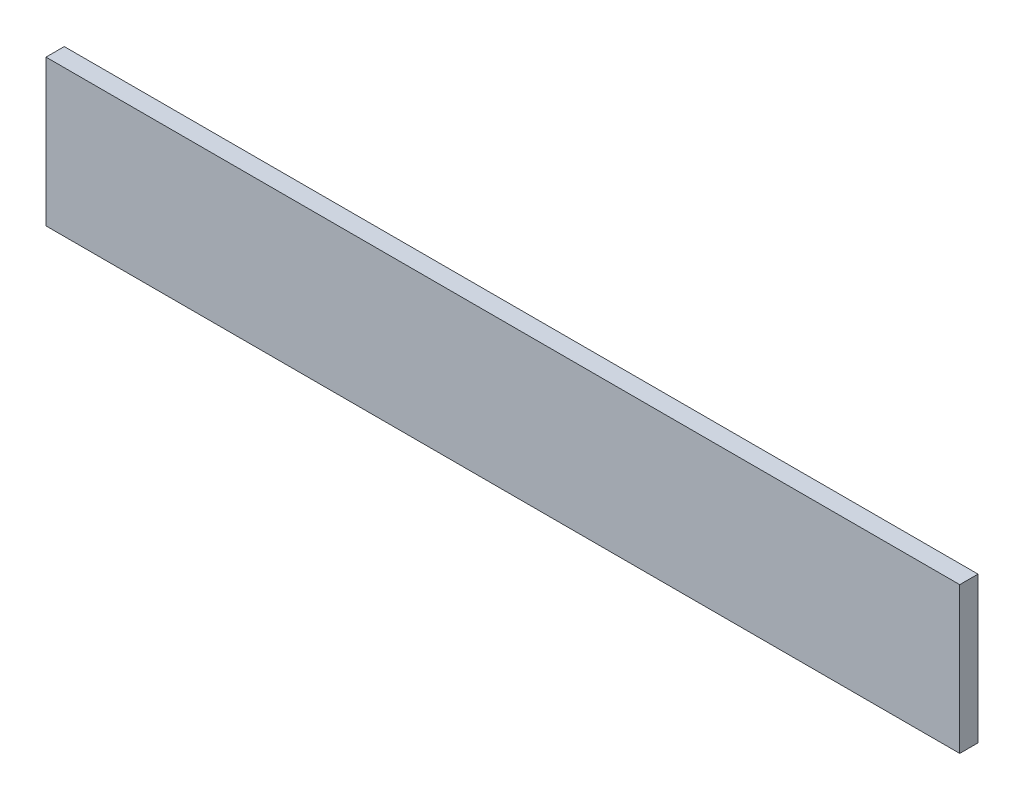
ISO-10303-21;
HEADER;
FILE_DESCRIPTION(('STEP AP214'),'2;1');
FILE_NAME('part.step','',(''),(''),'','','');
FILE_SCHEMA(('AUTOMOTIVE_DESIGN { 1 0 10303 214 1 1 1 1 }'));
ENDSEC;
DATA;
#1=APPLICATION_CONTEXT('core data for automotive mechanical design processes');
#2=APPLICATION_PROTOCOL_DEFINITION('international standard','automotive_design',2000,#1);
#3=PRODUCT_CONTEXT('',#1,'mechanical');
#4=PRODUCT('Part','Part','',(#3));
#5=PRODUCT_RELATED_PRODUCT_CATEGORY('part','',(#4));
#6=PRODUCT_DEFINITION_FORMATION('','',#4);
#7=PRODUCT_DEFINITION_CONTEXT('part definition',#1,'design');
#8=PRODUCT_DEFINITION('design','',#6,#7);
#9=PRODUCT_DEFINITION_SHAPE('','',#8);
#10=(LENGTH_UNIT() NAMED_UNIT(*) SI_UNIT(.MILLI.,.METRE.));
#11=(NAMED_UNIT(*) PLANE_ANGLE_UNIT() SI_UNIT($,.RADIAN.));
#12=(NAMED_UNIT(*) SI_UNIT($,.STERADIAN.) SOLID_ANGLE_UNIT());
#13=UNCERTAINTY_MEASURE_WITH_UNIT(LENGTH_MEASURE(1.E-05),#10,'distance_accuracy_value','');
#14=(GEOMETRIC_REPRESENTATION_CONTEXT(3) GLOBAL_UNCERTAINTY_ASSIGNED_CONTEXT((#13)) GLOBAL_UNIT_ASSIGNED_CONTEXT((#10,
#11,#12)) REPRESENTATION_CONTEXT('',''));
#15=CARTESIAN_POINT('',(0.,0.,0.));
#16=DIRECTION('',(0.,0.,1.));
#17=DIRECTION('',(1.,0.,0.));
#18=AXIS2_PLACEMENT_3D('',#15,#16,#17);
#19=CARTESIAN_POINT('',(0.,0.,5.));
#20=DIRECTION('',(-1.,0.,0.));
#21=DIRECTION('',(0.,0.,1.));
#22=AXIS2_PLACEMENT_3D('',#19,#20,#21);
#23=PLANE('',#22);
#24=DIRECTION('',(0.,1.,0.));
#25=VECTOR('',#24,1.);
#26=CARTESIAN_POINT('',(0.,0.,0.));
#27=LINE('',#26,#25);
#28=CARTESIAN_POINT('',(0.,0.,0.));
#29=VERTEX_POINT('',#28);
#30=CARTESIAN_POINT('',(0.,40.,0.));
#31=VERTEX_POINT('',#30);
#32=EDGE_CURVE('E96',#29,#31,#27,.T.);
#33=ORIENTED_EDGE('',*,*,#32,.T.);
#34=DIRECTION('',(0.,0.,-1.));
#35=VECTOR('',#34,1.);
#36=CARTESIAN_POINT('',(0.,40.,5.));
#37=LINE('',#36,#35);
#38=CARTESIAN_POINT('',(0.,40.,5.));
#39=VERTEX_POINT('',#38);
#40=EDGE_CURVE('E11',#39,#31,#37,.T.);
#41=ORIENTED_EDGE('',*,*,#40,.F.);
#42=DIRECTION('',(0.,1.,0.));
#43=VECTOR('',#42,1.);
#44=CARTESIAN_POINT('',(0.,0.,5.));
#45=LINE('',#44,#43);
#46=CARTESIAN_POINT('',(0.,0.,5.));
#47=VERTEX_POINT('',#46);
#48=EDGE_CURVE('E84',#47,#39,#45,.T.);
#49=ORIENTED_EDGE('',*,*,#48,.F.);
#50=DIRECTION('',(0.,0.,-1.));
#51=VECTOR('',#50,1.);
#52=CARTESIAN_POINT('',(0.,0.,5.));
#53=LINE('',#52,#51);
#54=EDGE_CURVE('E92',#47,#29,#53,.T.);
#55=ORIENTED_EDGE('',*,*,#54,.T.);
#56=EDGE_LOOP('',(#33,#41,#49,#55));
#57=FACE_BOUND('',#56,.T.);
#58=ADVANCED_FACE('F33',(#57),#23,.F.);
#59=CARTESIAN_POINT('',(0.,40.,5.));
#60=DIRECTION('',(0.,-1.,0.));
#61=DIRECTION('',(1.,0.,0.));
#62=AXIS2_PLACEMENT_3D('',#59,#60,#61);
#63=PLANE('',#62);
#64=DIRECTION('',(-1.,0.,0.));
#65=VECTOR('',#64,1.);
#66=CARTESIAN_POINT('',(0.,40.,0.));
#67=LINE('',#66,#65);
#68=CARTESIAN_POINT('',(-250.,40.,0.));
#69=VERTEX_POINT('',#68);
#70=EDGE_CURVE('E88',#31,#69,#67,.T.);
#71=ORIENTED_EDGE('',*,*,#70,.T.);
#72=DIRECTION('',(0.,0.,-1.));
#73=VECTOR('',#72,1.);
#74=CARTESIAN_POINT('',(-250.,40.,5.));
#75=LINE('',#74,#73);
#76=CARTESIAN_POINT('',(-250.,40.,5.));
#77=VERTEX_POINT('',#76);
#78=EDGE_CURVE('E41',#77,#69,#75,.T.);
#79=ORIENTED_EDGE('',*,*,#78,.F.);
#80=DIRECTION('',(-1.,0.,0.));
#81=VECTOR('',#80,1.);
#82=CARTESIAN_POINT('',(0.,40.,5.));
#83=LINE('',#82,#81);
#84=EDGE_CURVE('E79',#39,#77,#83,.T.);
#85=ORIENTED_EDGE('',*,*,#84,.F.);
#86=ORIENTED_EDGE('',*,*,#40,.T.);
#87=EDGE_LOOP('',(#71,#79,#85,#86));
#88=FACE_BOUND('',#87,.T.);
#89=ADVANCED_FACE('F87',(#88),#63,.F.);
#90=CARTESIAN_POINT('',(-250.,0.,5.));
#91=DIRECTION('',(1.,0.,0.));
#92=DIRECTION('',(0.,0.,-1.));
#93=AXIS2_PLACEMENT_3D('',#90,#91,#92);
#94=PLANE('',#93);
#95=DIRECTION('',(0.,-1.,0.));
#96=VECTOR('',#95,1.);
#97=CARTESIAN_POINT('',(-250.,0.,0.));
#98=LINE('',#97,#96);
#99=CARTESIAN_POINT('',(-250.,0.,0.));
#100=VERTEX_POINT('',#99);
#101=EDGE_CURVE('E66',#69,#100,#98,.T.);
#102=ORIENTED_EDGE('',*,*,#101,.T.);
#103=DIRECTION('',(0.,0.,-1.));
#104=VECTOR('',#103,1.);
#105=CARTESIAN_POINT('',(-250.,0.,5.));
#106=LINE('',#105,#104);
#107=CARTESIAN_POINT('',(-250.,0.,5.));
#108=VERTEX_POINT('',#107);
#109=EDGE_CURVE('E89',#108,#100,#106,.T.);
#110=ORIENTED_EDGE('',*,*,#109,.F.);
#111=DIRECTION('',(0.,-1.,0.));
#112=VECTOR('',#111,1.);
#113=CARTESIAN_POINT('',(-250.,0.,5.));
#114=LINE('',#113,#112);
#115=EDGE_CURVE('E82',#77,#108,#114,.T.);
#116=ORIENTED_EDGE('',*,*,#115,.F.);
#117=ORIENTED_EDGE('',*,*,#78,.T.);
#118=EDGE_LOOP('',(#102,#110,#116,#117));
#119=FACE_BOUND('',#118,.T.);
#120=ADVANCED_FACE('F90',(#119),#94,.F.);
#121=CARTESIAN_POINT('',(0.,0.,5.));
#122=DIRECTION('',(0.,1.,0.));
#123=DIRECTION('',(-1.,0.,0.));
#124=AXIS2_PLACEMENT_3D('',#121,#122,#123);
#125=PLANE('',#124);
#126=DIRECTION('',(1.,0.,0.));
#127=VECTOR('',#126,1.);
#128=CARTESIAN_POINT('',(0.,0.,0.));
#129=LINE('',#128,#127);
#130=EDGE_CURVE('E72',#100,#29,#129,.T.);
#131=ORIENTED_EDGE('',*,*,#130,.T.);
#132=ORIENTED_EDGE('',*,*,#54,.F.);
#133=DIRECTION('',(1.,0.,0.));
#134=VECTOR('',#133,1.);
#135=CARTESIAN_POINT('',(0.,0.,5.));
#136=LINE('',#135,#134);
#137=EDGE_CURVE('E49',#108,#47,#136,.T.);
#138=ORIENTED_EDGE('',*,*,#137,.F.);
#139=ORIENTED_EDGE('',*,*,#109,.T.);
#140=EDGE_LOOP('',(#131,#132,#138,#139));
#141=FACE_BOUND('',#140,.T.);
#142=ADVANCED_FACE('F103',(#141),#125,.F.);
#143=CARTESIAN_POINT('',(0.,0.,5.));
#144=DIRECTION('',(0.,0.,1.));
#145=DIRECTION('',(1.,0.,0.));
#146=AXIS2_PLACEMENT_3D('',#143,#144,#145);
#147=PLANE('',#146);
#148=ORIENTED_EDGE('',*,*,#48,.T.);
#149=ORIENTED_EDGE('',*,*,#84,.T.);
#150=ORIENTED_EDGE('',*,*,#115,.T.);
#151=ORIENTED_EDGE('',*,*,#137,.T.);
#152=EDGE_LOOP('',(#148,#149,#150,#151));
#153=FACE_BOUND('',#152,.T.);
#154=ADVANCED_FACE('F80',(#153),#147,.T.);
#155=CARTESIAN_POINT('',(0.,0.,0.));
#156=DIRECTION('',(0.,0.,1.));
#157=DIRECTION('',(1.,0.,0.));
#158=AXIS2_PLACEMENT_3D('',#155,#156,#157);
#159=PLANE('',#158);
#160=ORIENTED_EDGE('',*,*,#32,.F.);
#161=ORIENTED_EDGE('',*,*,#130,.F.);
#162=ORIENTED_EDGE('',*,*,#101,.F.);
#163=ORIENTED_EDGE('',*,*,#70,.F.);
#164=EDGE_LOOP('',(#160,#161,#162,#163));
#165=FACE_BOUND('',#164,.T.);
#166=ADVANCED_FACE('F106',(#165),#159,.F.);
#167=CLOSED_SHELL('',(#58,#89,#120,#142,#154,#166));
#168=MANIFOLD_SOLID_BREP('B2',#167);
#169=ADVANCED_BREP_SHAPE_REPRESENTATION('',(#18,#168),#14);
#170=SHAPE_DEFINITION_REPRESENTATION(#9,#169);
ENDSEC;
END-ISO-10303-21;
